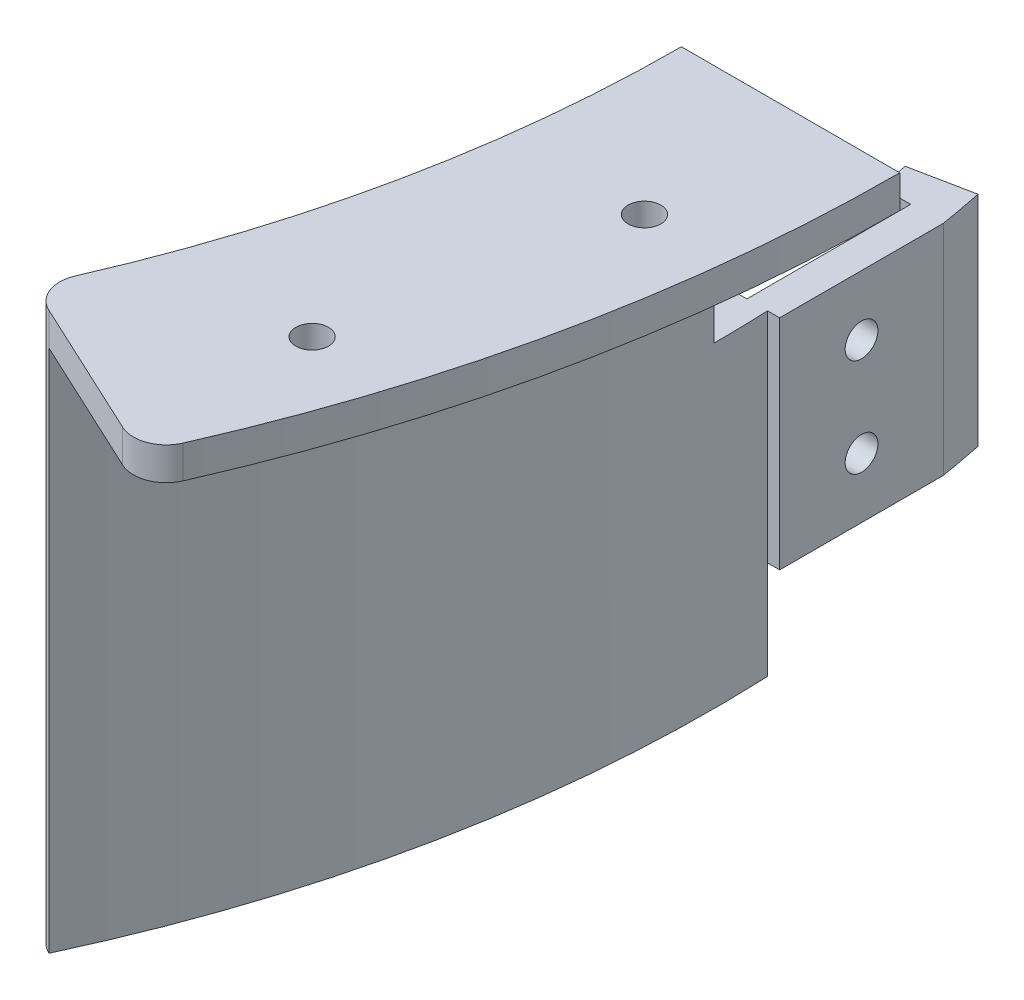
ISO-10303-21;
HEADER;
FILE_DESCRIPTION(('STEP AP214'),'2;1');
FILE_NAME('part.step','',(''),(''),'','','');
FILE_SCHEMA(('AUTOMOTIVE_DESIGN { 1 0 10303 214 1 1 1 1 }'));
ENDSEC;
DATA;
#1=APPLICATION_CONTEXT('core data for automotive mechanical design processes');
#2=APPLICATION_PROTOCOL_DEFINITION('international standard','automotive_design',2000,#1);
#3=PRODUCT_CONTEXT('',#1,'mechanical');
#4=PRODUCT('Part','Part','',(#3));
#5=PRODUCT_RELATED_PRODUCT_CATEGORY('part','',(#4));
#6=PRODUCT_DEFINITION_FORMATION('','',#4);
#7=PRODUCT_DEFINITION_CONTEXT('part definition',#1,'design');
#8=PRODUCT_DEFINITION('design','',#6,#7);
#9=PRODUCT_DEFINITION_SHAPE('','',#8);
#10=(LENGTH_UNIT() NAMED_UNIT(*) SI_UNIT(.MILLI.,.METRE.));
#11=(NAMED_UNIT(*) PLANE_ANGLE_UNIT() SI_UNIT($,.RADIAN.));
#12=(NAMED_UNIT(*) SI_UNIT($,.STERADIAN.) SOLID_ANGLE_UNIT());
#13=UNCERTAINTY_MEASURE_WITH_UNIT(LENGTH_MEASURE(1.E-05),#10,'distance_accuracy_value','');
#14=(GEOMETRIC_REPRESENTATION_CONTEXT(3) GLOBAL_UNCERTAINTY_ASSIGNED_CONTEXT((#13)) GLOBAL_UNIT_ASSIGNED_CONTEXT((#10,
#11,#12)) REPRESENTATION_CONTEXT('',''));
#15=CARTESIAN_POINT('',(0.,0.,0.));
#16=DIRECTION('',(0.,0.,1.));
#17=DIRECTION('',(1.,0.,0.));
#18=AXIS2_PLACEMENT_3D('',#15,#16,#17);
#19=CARTESIAN_POINT('',(0.,-64.,0.));
#20=DIRECTION('',(0.,1.,0.));
#21=DIRECTION('',(0.,0.,-1.));
#22=AXIS2_PLACEMENT_3D('',#19,#20,#21);
#23=CYLINDRICAL_SURFACE('',#22,115.);
#24=CARTESIAN_POINT('',(0.,0.,0.));
#25=DIRECTION('',(0.,-1.,0.));
#26=DIRECTION('',(0.,0.,-1.));
#27=AXIS2_PLACEMENT_3D('',#24,#25,#26);
#28=CIRCLE('',#27,115.);
#29=CARTESIAN_POINT('',(115.,0.,0.));
#30=VERTEX_POINT('',#29);
#31=CARTESIAN_POINT('',(105.427327378107,0.,45.9355923213096));
#32=VERTEX_POINT('',#31);
#33=EDGE_CURVE('E279',#30,#32,#28,.T.);
#34=ORIENTED_EDGE('',*,*,#33,.F.);
#35=DIRECTION('',(0.,1.,0.));
#36=VECTOR('',#35,1.);
#37=CARTESIAN_POINT('',(115.,-22.,0.));
#38=LINE('',#37,#36);
#39=CARTESIAN_POINT('',(115.,-22.,0.));
#40=VERTEX_POINT('',#39);
#41=EDGE_CURVE('E237',#40,#30,#38,.T.);
#42=ORIENTED_EDGE('',*,*,#41,.F.);
#43=CARTESIAN_POINT('',(0.,-22.,0.));
#44=DIRECTION('',(0.,-1.,0.));
#45=DIRECTION('',(0.,0.,-1.));
#46=AXIS2_PLACEMENT_3D('',#43,#44,#45);
#47=CIRCLE('',#46,115.);
#48=CARTESIAN_POINT('',(114.891252930761,-22.,-5.00000000000003));
#49=VERTEX_POINT('',#48);
#50=EDGE_CURVE('E221',#40,#49,#47,.F.);
#51=ORIENTED_EDGE('',*,*,#50,.T.);
#52=DIRECTION('',(0.,1.,0.));
#53=VECTOR('',#52,1.);
#54=CARTESIAN_POINT('',(114.891252930761,-64.,-5.));
#55=LINE('',#54,#53);
#56=CARTESIAN_POINT('',(114.891252930761,-51.,-4.99999999999999));
#57=VERTEX_POINT('',#56);
#58=EDGE_CURVE('E296',#57,#49,#55,.T.);
#59=ORIENTED_EDGE('',*,*,#58,.F.);
#60=CARTESIAN_POINT('',(0.,-51.,0.));
#61=DIRECTION('',(0.,-1.,0.));
#62=DIRECTION('',(0.,0.,1.));
#63=AXIS2_PLACEMENT_3D('',#60,#61,#62);
#64=CIRCLE('',#63,115.);
#65=CARTESIAN_POINT('',(105.427327378106,-51.,45.9355923213096));
#66=VERTEX_POINT('',#65);
#67=EDGE_CURVE('E183',#57,#66,#64,.T.);
#68=ORIENTED_EDGE('',*,*,#67,.T.);
#69=DIRECTION('',(0.,1.,0.));
#70=VECTOR('',#69,1.);
#71=CARTESIAN_POINT('',(105.427327378106,-64.,45.9355923213096));
#72=LINE('',#71,#70);
#73=EDGE_CURVE('E45',#32,#66,#72,.F.);
#74=ORIENTED_EDGE('',*,*,#73,.F.);
#75=EDGE_LOOP('',(#34,#42,#51,#59,#68,#74));
#76=FACE_BOUND('',#75,.T.);
#77=ADVANCED_FACE('F37',(#76),#23,.F.);
#78=CARTESIAN_POINT('',(113.,-84.,-5.));
#79=DIRECTION('',(0.,0.,1.));
#80=DIRECTION('',(-1.,0.,0.));
#81=AXIS2_PLACEMENT_3D('',#78,#79,#80);
#82=PLANE('',#81);
#83=DIRECTION('',(-1.,0.,0.));
#84=VECTOR('',#83,1.);
#85=CARTESIAN_POINT('',(117.894020204589,-51.,-5.));
#86=LINE('',#85,#84);
#87=CARTESIAN_POINT('',(117.894020204589,-51.,-5.));
#88=VERTEX_POINT('',#87);
#89=EDGE_CURVE('E169',#88,#57,#86,.T.);
#90=ORIENTED_EDGE('',*,*,#89,.T.);
#91=ORIENTED_EDGE('',*,*,#58,.T.);
#92=DIRECTION('',(1.,0.,0.));
#93=VECTOR('',#92,1.);
#94=CARTESIAN_POINT('',(0.,-22.,-5.00000000000003));
#95=LINE('',#94,#93);
#96=CARTESIAN_POINT('',(116.,-22.,-5.));
#97=VERTEX_POINT('',#96);
#98=EDGE_CURVE('E224',#49,#97,#95,.T.);
#99=ORIENTED_EDGE('',*,*,#98,.T.);
#100=DIRECTION('',(0.,1.,0.));
#101=VECTOR('',#100,1.);
#102=CARTESIAN_POINT('',(116.,-84.,-5.));
#103=LINE('',#102,#101);
#104=CARTESIAN_POINT('',(116.,-42.,-5.));
#105=VERTEX_POINT('',#104);
#106=EDGE_CURVE('E276',#105,#97,#103,.T.);
#107=ORIENTED_EDGE('',*,*,#106,.F.);
#108=DIRECTION('',(1.,0.,0.));
#109=VECTOR('',#108,1.);
#110=CARTESIAN_POINT('',(116.,-42.,-5.));
#111=LINE('',#110,#109);
#112=CARTESIAN_POINT('',(117.894020204589,-42.,-5.));
#113=VERTEX_POINT('',#112);
#114=EDGE_CURVE('E177',#105,#113,#111,.T.);
#115=ORIENTED_EDGE('',*,*,#114,.T.);
#116=DIRECTION('',(0.,-1.,0.));
#117=VECTOR('',#116,1.);
#118=CARTESIAN_POINT('',(117.894020204589,-3.,-5.));
#119=LINE('',#118,#117);
#120=EDGE_CURVE('E163',#113,#88,#119,.T.);
#121=ORIENTED_EDGE('',*,*,#120,.T.);
#122=EDGE_LOOP('',(#90,#91,#99,#107,#115,#121));
#123=FACE_BOUND('',#122,.T.);
#124=ADVANCED_FACE('F173',(#123),#82,.F.);
#125=CARTESIAN_POINT('',(0.,-3.,0.));
#126=DIRECTION('',(0.,-1.,0.));
#127=DIRECTION('',(0.,0.,1.));
#128=AXIS2_PLACEMENT_3D('',#125,#126,#127);
#129=CYLINDRICAL_SURFACE('',#128,118.);
#130=CARTESIAN_POINT('',(0.,-51.,0.));
#131=DIRECTION('',(0.,1.,0.));
#132=DIRECTION('',(0.,0.,1.));
#133=AXIS2_PLACEMENT_3D('',#130,#131,#132);
#134=CIRCLE('',#133,118.);
#135=CARTESIAN_POINT('',(106.944318870325,-51.,49.8689548854027));
#136=VERTEX_POINT('',#135);
#137=EDGE_CURVE('E159',#136,#88,#134,.T.);
#138=ORIENTED_EDGE('',*,*,#137,.T.);
#139=ORIENTED_EDGE('',*,*,#120,.F.);
#140=DIRECTION('',(0.,-1.,0.));
#141=VECTOR('',#140,1.);
#142=CARTESIAN_POINT('',(117.894020204589,-3.,-5.));
#143=LINE('',#142,#141);
#144=CARTESIAN_POINT('',(117.894020204589,-22.,-5.));
#145=VERTEX_POINT('',#144);
#146=EDGE_CURVE('E262',#145,#113,#143,.T.);
#147=ORIENTED_EDGE('',*,*,#146,.F.);
#148=CARTESIAN_POINT('',(0.,-22.,0.));
#149=DIRECTION('',(0.,-1.,0.));
#150=DIRECTION('',(0.,0.,-1.));
#151=AXIS2_PLACEMENT_3D('',#148,#149,#150);
#152=CIRCLE('',#151,118.);
#153=CARTESIAN_POINT('',(118.,-22.,0.));
#154=VERTEX_POINT('',#153);
#155=EDGE_CURVE('E251',#145,#154,#152,.T.);
#156=ORIENTED_EDGE('',*,*,#155,.T.);
#157=DIRECTION('',(0.,-1.,0.));
#158=VECTOR('',#157,1.);
#159=CARTESIAN_POINT('',(118.,-3.,0.));
#160=LINE('',#159,#158);
#161=CARTESIAN_POINT('',(118.,-3.,0.));
#162=VERTEX_POINT('',#161);
#163=EDGE_CURVE('E242',#154,#162,#160,.F.);
#164=ORIENTED_EDGE('',*,*,#163,.T.);
#165=CARTESIAN_POINT('',(0.,-3.,0.));
#166=DIRECTION('',(0.,-1.,0.));
#167=DIRECTION('',(0.,0.,1.));
#168=AXIS2_PLACEMENT_3D('',#165,#166,#167);
#169=CIRCLE('',#168,118.);
#170=CARTESIAN_POINT('',(106.944318870325,-3.,49.8689548854027));
#171=VERTEX_POINT('',#170);
#172=EDGE_CURVE('E254',#162,#171,#169,.T.);
#173=ORIENTED_EDGE('',*,*,#172,.T.);
#174=DIRECTION('',(0.,-1.,0.));
#175=VECTOR('',#174,1.);
#176=CARTESIAN_POINT('',(106.944318870325,-3.,49.8689548854027));
#177=LINE('',#176,#175);
#178=EDGE_CURVE('E167',#171,#136,#177,.T.);
#179=ORIENTED_EDGE('',*,*,#178,.T.);
#180=EDGE_LOOP('',(#138,#139,#147,#156,#164,#173,#179));
#181=FACE_BOUND('',#180,.T.);
#182=ADVANCED_FACE('F161',(#181),#129,.T.);
#183=CARTESIAN_POINT('',(0.,-64.,0.));
#184=DIRECTION('',(-0.422618261740701,0.,0.906307787036649));
#185=DIRECTION('',(-0.906307787036649,0.,-0.422618261740701));
#186=AXIS2_PLACEMENT_3D('',#183,#184,#185);
#187=PLANE('',#186);
#188=DIRECTION('',(0.906307787036652,0.,0.422618261740695));
#189=VECTOR('',#188,1.);
#190=CARTESIAN_POINT('',(106.944318870325,-51.,49.8689548854027));
#191=LINE('',#190,#189);
#192=CARTESIAN_POINT('',(106.9097506984,-51.,49.8528354821059));
#193=VERTEX_POINT('',#192);
#194=EDGE_CURVE('E186',#193,#136,#191,.T.);
#195=ORIENTED_EDGE('',*,*,#194,.T.);
#196=ORIENTED_EDGE('',*,*,#178,.F.);
#197=DIRECTION('',(0.906307787036649,0.,0.422618261740701));
#198=VECTOR('',#197,1.);
#199=CARTESIAN_POINT('',(106.944318870325,-3.,49.8689548854027));
#200=LINE('',#199,#198);
#201=CARTESIAN_POINT('',(119.601727041651,-3.,55.7712012480857));
#202=VERTEX_POINT('',#201);
#203=EDGE_CURVE('E256',#171,#202,#200,.T.);
#204=ORIENTED_EDGE('',*,*,#203,.T.);
#205=DIRECTION('',(0.,1.,0.));
#206=VECTOR('',#205,1.);
#207=CARTESIAN_POINT('',(119.601727041651,-64.,55.7712012480857));
#208=LINE('',#207,#206);
#209=CARTESIAN_POINT('',(119.601727041651,0.,55.7712012480857));
#210=VERTEX_POINT('',#209);
#211=EDGE_CURVE('E307',#210,#202,#208,.F.);
#212=ORIENTED_EDGE('',*,*,#211,.F.);
#213=DIRECTION('',(-0.906307787036649,0.,-0.422618261740701));
#214=VECTOR('',#213,1.);
#215=CARTESIAN_POINT('',(0.,0.,0.));
#216=LINE('',#215,#214);
#217=CARTESIAN_POINT('',(106.9097506984,0.,49.8528354821059));
#218=VERTEX_POINT('',#217);
#219=EDGE_CURVE('E290',#210,#218,#216,.T.);
#220=ORIENTED_EDGE('',*,*,#219,.T.);
#221=DIRECTION('',(0.,-1.,0.));
#222=VECTOR('',#221,1.);
#223=CARTESIAN_POINT('',(106.9097506984,0.,49.8528354821059));
#224=LINE('',#223,#222);
#225=EDGE_CURVE('E312',#193,#218,#224,.F.);
#226=ORIENTED_EDGE('',*,*,#225,.F.);
#227=EDGE_LOOP('',(#195,#196,#204,#212,#220,#226));
#228=FACE_BOUND('',#227,.T.);
#229=ADVANCED_FACE('F351',(#228),#187,.T.);
#230=CARTESIAN_POINT('',(132.328890592719,-64.,-26.7219893439865));
#231=DIRECTION('',(-0.197940661807307,0.,-0.980214004390513));
#232=DIRECTION('',(0.980214004390513,0.,-0.197940661807307));
#233=AXIS2_PLACEMENT_3D('',#230,#231,#232);
#234=PLANE('',#233);
#235=DIRECTION('',(0.,1.,0.));
#236=VECTOR('',#235,1.);
#237=CARTESIAN_POINT('',(112.724610504909,-64.,-22.7631761078404));
#238=LINE('',#237,#236);
#239=CARTESIAN_POINT('',(112.724610504909,-42.,-22.7631761078404));
#240=VERTEX_POINT('',#239);
#241=CARTESIAN_POINT('',(112.724610504909,-22.,-22.7631761078403));
#242=VERTEX_POINT('',#241);
#243=EDGE_CURVE('E284',#240,#242,#238,.T.);
#244=ORIENTED_EDGE('',*,*,#243,.T.);
#245=DIRECTION('',(0.980214004390513,0.,-0.197940661807307));
#246=VECTOR('',#245,1.);
#247=CARTESIAN_POINT('',(0.,-22.,0.));
#248=LINE('',#247,#246);
#249=CARTESIAN_POINT('',(118.281412986176,-22.,-23.8852955182423));
#250=VERTEX_POINT('',#249);
#251=EDGE_CURVE('E234',#242,#250,#248,.T.);
#252=ORIENTED_EDGE('',*,*,#251,.T.);
#253=DIRECTION('',(0.,-1.,0.));
#254=VECTOR('',#253,1.);
#255=CARTESIAN_POINT('',(118.281412986176,-3.,-23.8852955182423));
#256=LINE('',#255,#254);
#257=CARTESIAN_POINT('',(118.281412986176,-42.,-23.8852955182423));
#258=VERTEX_POINT('',#257);
#259=EDGE_CURVE('E272',#250,#258,#256,.T.);
#260=ORIENTED_EDGE('',*,*,#259,.T.);
#261=DIRECTION('',(-0.980214004390514,0.,0.197940661807305));
#262=VECTOR('',#261,1.);
#263=CARTESIAN_POINT('',(118.281412986176,-42.,-23.8852955182423));
#264=LINE('',#263,#262);
#265=EDGE_CURVE('E212',#258,#240,#264,.T.);
#266=ORIENTED_EDGE('',*,*,#265,.T.);
#267=EDGE_LOOP('',(#244,#252,#260,#266));
#268=FACE_BOUND('',#267,.T.);
#269=ADVANCED_FACE('F382',(#268),#234,.T.);
#270=CARTESIAN_POINT('',(0.,-42.,0.));
#271=DIRECTION('',(0.,-1.,0.));
#272=DIRECTION('',(0.,0.,1.));
#273=AXIS2_PLACEMENT_3D('',#270,#271,#272);
#274=CIRCLE('',#273,115.);
#275=CARTESIAN_POINT('',(113.247516529061,-42.,-20.));
#276=VERTEX_POINT('',#275);
#277=EDGE_CURVE('E215',#240,#276,#274,.T.);
#278=ORIENTED_EDGE('',*,*,#277,.T.);
#279=DIRECTION('',(0.,1.,0.));
#280=VECTOR('',#279,1.);
#281=CARTESIAN_POINT('',(113.247516529061,-64.,-20.));
#282=LINE('',#281,#280);
#283=CARTESIAN_POINT('',(113.247516529061,-22.,-20.));
#284=VERTEX_POINT('',#283);
#285=EDGE_CURVE('E293',#284,#276,#282,.F.);
#286=ORIENTED_EDGE('',*,*,#285,.F.);
#287=CARTESIAN_POINT('',(0.,-22.,0.));
#288=DIRECTION('',(0.,-1.,0.));
#289=DIRECTION('',(0.,0.,-1.));
#290=AXIS2_PLACEMENT_3D('',#287,#288,#289);
#291=CIRCLE('',#290,115.);
#292=EDGE_CURVE('E232',#284,#242,#291,.F.);
#293=ORIENTED_EDGE('',*,*,#292,.T.);
#294=ORIENTED_EDGE('',*,*,#243,.F.);
#295=EDGE_LOOP('',(#278,#286,#293,#294));
#296=FACE_BOUND('',#295,.T.);
#297=ADVANCED_FACE('F374',(#296),#23,.F.);
#298=CARTESIAN_POINT('',(116.,-84.,-5.));
#299=DIRECTION('',(1.,0.,0.));
#300=DIRECTION('',(0.,0.,1.));
#301=AXIS2_PLACEMENT_3D('',#298,#299,#300);
#302=PLANE('',#301);
#303=CARTESIAN_POINT('',(116.,-27.5,-12.5));
#304=DIRECTION('',(-1.,0.,0.));
#305=DIRECTION('',(0.,0.,1.));
#306=AXIS2_PLACEMENT_3D('',#303,#304,#305);
#307=CIRCLE('',#306,1.5);
#308=CARTESIAN_POINT('',(116.,-27.5,-11.));
#309=VERTEX_POINT('',#308);
#310=EDGE_CURVE('E200',#309,#309,#307,.T.);
#311=ORIENTED_EDGE('',*,*,#310,.F.);
#312=EDGE_LOOP('',(#311));
#313=FACE_BOUND('',#312,.T.);
#314=CARTESIAN_POINT('',(116.,-36.5,-12.5));
#315=DIRECTION('',(-1.,0.,0.));
#316=DIRECTION('',(0.,0.,1.));
#317=AXIS2_PLACEMENT_3D('',#314,#315,#316);
#318=CIRCLE('',#317,1.5);
#319=CARTESIAN_POINT('',(116.,-36.5,-11.));
#320=VERTEX_POINT('',#319);
#321=EDGE_CURVE('E195',#320,#320,#318,.T.);
#322=ORIENTED_EDGE('',*,*,#321,.F.);
#323=EDGE_LOOP('',(#322));
#324=FACE_BOUND('',#323,.T.);
#325=DIRECTION('',(0.,0.,1.));
#326=VECTOR('',#325,1.);
#327=CARTESIAN_POINT('',(116.,-42.,-20.));
#328=LINE('',#327,#326);
#329=CARTESIAN_POINT('',(116.,-42.,-20.));
#330=VERTEX_POINT('',#329);
#331=EDGE_CURVE('E203',#330,#105,#328,.T.);
#332=ORIENTED_EDGE('',*,*,#331,.T.);
#333=ORIENTED_EDGE('',*,*,#106,.T.);
#334=DIRECTION('',(0.,0.,-1.));
#335=VECTOR('',#334,1.);
#336=CARTESIAN_POINT('',(116.,-22.,1.07321559047098E-13));
#337=LINE('',#336,#335);
#338=CARTESIAN_POINT('',(116.,-22.,-20.));
#339=VERTEX_POINT('',#338);
#340=EDGE_CURVE('E227',#97,#339,#337,.T.);
#341=ORIENTED_EDGE('',*,*,#340,.T.);
#342=DIRECTION('',(0.,1.,0.));
#343=VECTOR('',#342,1.);
#344=CARTESIAN_POINT('',(116.,-84.,-20.));
#345=LINE('',#344,#343);
#346=EDGE_CURVE('E265',#330,#339,#345,.T.);
#347=ORIENTED_EDGE('',*,*,#346,.F.);
#348=EDGE_LOOP('',(#332,#333,#341,#347));
#349=FACE_BOUND('',#348,.T.);
#350=ADVANCED_FACE('F331',(#313,#324,#349),#302,.F.);
#351=CARTESIAN_POINT('',(113.,-84.,-20.));
#352=DIRECTION('',(0.,0.,-1.));
#353=DIRECTION('',(1.,0.,0.));
#354=AXIS2_PLACEMENT_3D('',#351,#352,#353);
#355=PLANE('',#354);
#356=DIRECTION('',(1.,0.,0.));
#357=VECTOR('',#356,1.);
#358=CARTESIAN_POINT('',(113.247516529061,-42.,-20.));
#359=LINE('',#358,#357);
#360=EDGE_CURVE('E179',#276,#330,#359,.T.);
#361=ORIENTED_EDGE('',*,*,#360,.T.);
#362=ORIENTED_EDGE('',*,*,#346,.T.);
#363=DIRECTION('',(-1.,0.,0.));
#364=VECTOR('',#363,1.);
#365=CARTESIAN_POINT('',(0.,-22.,-20.));
#366=LINE('',#365,#364);
#367=EDGE_CURVE('E230',#339,#284,#366,.T.);
#368=ORIENTED_EDGE('',*,*,#367,.T.);
#369=ORIENTED_EDGE('',*,*,#285,.T.);
#370=EDGE_LOOP('',(#361,#362,#368,#369));
#371=FACE_BOUND('',#370,.T.);
#372=ADVANCED_FACE('F388',(#371),#355,.F.);
#373=CARTESIAN_POINT('',(119.,-3.,-5.));
#374=DIRECTION('',(0.,0.,-1.));
#375=DIRECTION('',(1.,0.,0.));
#376=AXIS2_PLACEMENT_3D('',#373,#374,#375);
#377=PLANE('',#376);
#378=CARTESIAN_POINT('',(119.,-42.,-5.));
#379=VERTEX_POINT('',#378);
#380=EDGE_CURVE('E205',#113,#379,#111,.T.);
#381=ORIENTED_EDGE('',*,*,#380,.T.);
#382=DIRECTION('',(0.,-1.,0.));
#383=VECTOR('',#382,1.);
#384=CARTESIAN_POINT('',(119.,-3.,-5.));
#385=LINE('',#384,#383);
#386=CARTESIAN_POINT('',(119.,-22.,-5.));
#387=VERTEX_POINT('',#386);
#388=EDGE_CURVE('E266',#387,#379,#385,.T.);
#389=ORIENTED_EDGE('',*,*,#388,.F.);
#390=DIRECTION('',(-1.,0.,0.));
#391=VECTOR('',#390,1.);
#392=CARTESIAN_POINT('',(119.,-22.,-5.));
#393=LINE('',#392,#391);
#394=EDGE_CURVE('E249',#387,#145,#393,.T.);
#395=ORIENTED_EDGE('',*,*,#394,.T.);
#396=ORIENTED_EDGE('',*,*,#146,.T.);
#397=EDGE_LOOP('',(#381,#389,#395,#396));
#398=FACE_BOUND('',#397,.T.);
#399=ADVANCED_FACE('F338',(#398),#377,.F.);
#400=CARTESIAN_POINT('',(119.,-3.,-20.));
#401=DIRECTION('',(-1.,0.,0.));
#402=DIRECTION('',(0.,0.,-1.));
#403=AXIS2_PLACEMENT_3D('',#400,#401,#402);
#404=PLANE('',#403);
#405=CARTESIAN_POINT('',(119.,-27.5,-12.5));
#406=DIRECTION('',(-1.,0.,0.));
#407=DIRECTION('',(0.,0.,1.));
#408=AXIS2_PLACEMENT_3D('',#405,#406,#407);
#409=CIRCLE('',#408,1.5);
#410=CARTESIAN_POINT('',(119.,-27.5,-11.));
#411=VERTEX_POINT('',#410);
#412=EDGE_CURVE('E192',#411,#411,#409,.T.);
#413=ORIENTED_EDGE('',*,*,#412,.T.);
#414=EDGE_LOOP('',(#413));
#415=FACE_BOUND('',#414,.T.);
#416=CARTESIAN_POINT('',(119.,-36.5,-12.5));
#417=DIRECTION('',(-1.,0.,0.));
#418=DIRECTION('',(0.,0.,1.));
#419=AXIS2_PLACEMENT_3D('',#416,#417,#418);
#420=CIRCLE('',#419,1.5);
#421=CARTESIAN_POINT('',(119.,-36.5,-11.));
#422=VERTEX_POINT('',#421);
#423=EDGE_CURVE('E191',#422,#422,#420,.T.);
#424=ORIENTED_EDGE('',*,*,#423,.T.);
#425=EDGE_LOOP('',(#424));
#426=FACE_BOUND('',#425,.T.);
#427=DIRECTION('',(0.,0.,-1.));
#428=VECTOR('',#427,1.);
#429=CARTESIAN_POINT('',(119.,-42.,-5.));
#430=LINE('',#429,#428);
#431=CARTESIAN_POINT('',(119.,-42.,-20.));
#432=VERTEX_POINT('',#431);
#433=EDGE_CURVE('E207',#379,#432,#430,.T.);
#434=ORIENTED_EDGE('',*,*,#433,.T.);
#435=DIRECTION('',(0.,-1.,0.));
#436=VECTOR('',#435,1.);
#437=CARTESIAN_POINT('',(119.,-3.,-20.));
#438=LINE('',#437,#436);
#439=CARTESIAN_POINT('',(119.,-22.,-20.));
#440=VERTEX_POINT('',#439);
#441=EDGE_CURVE('E269',#440,#432,#438,.T.);
#442=ORIENTED_EDGE('',*,*,#441,.F.);
#443=DIRECTION('',(0.,0.,1.));
#444=VECTOR('',#443,1.);
#445=CARTESIAN_POINT('',(119.,-22.,-20.));
#446=LINE('',#445,#444);
#447=EDGE_CURVE('E247',#440,#387,#446,.T.);
#448=ORIENTED_EDGE('',*,*,#447,.T.);
#449=ORIENTED_EDGE('',*,*,#388,.T.);
#450=EDGE_LOOP('',(#434,#442,#448,#449));
#451=FACE_BOUND('',#450,.T.);
#452=ADVANCED_FACE('F401',(#415,#426,#451),#404,.F.);
#453=CARTESIAN_POINT('',(0.,-3.,0.));
#454=DIRECTION('',(0.,-1.,0.));
#455=DIRECTION('',(0.,0.,1.));
#456=AXIS2_PLACEMENT_3D('',#453,#454,#455);
#457=CYLINDRICAL_SURFACE('',#456,120.668968670491);
#458=CARTESIAN_POINT('',(0.,-42.,0.));
#459=DIRECTION('',(0.,1.,0.));
#460=DIRECTION('',(0.,0.,1.));
#461=AXIS2_PLACEMENT_3D('',#458,#459,#460);
#462=CIRCLE('',#461,120.668968670491);
#463=EDGE_CURVE('E210',#432,#258,#462,.T.);
#464=ORIENTED_EDGE('',*,*,#463,.T.);
#465=ORIENTED_EDGE('',*,*,#259,.F.);
#466=CARTESIAN_POINT('',(0.,-22.,0.));
#467=DIRECTION('',(0.,-1.,0.));
#468=DIRECTION('',(0.,0.,-1.));
#469=AXIS2_PLACEMENT_3D('',#466,#467,#468);
#470=CIRCLE('',#469,120.668968670491);
#471=EDGE_CURVE('E300',#250,#440,#470,.T.);
#472=ORIENTED_EDGE('',*,*,#471,.T.);
#473=ORIENTED_EDGE('',*,*,#441,.T.);
#474=EDGE_LOOP('',(#464,#465,#472,#473));
#475=FACE_BOUND('',#474,.T.);
#476=ADVANCED_FACE('F398',(#475),#457,.T.);
#477=CARTESIAN_POINT('',(0.,-64.,0.));
#478=DIRECTION('',(0.,1.,0.));
#479=DIRECTION('',(0.,0.,-1.));
#480=AXIS2_PLACEMENT_3D('',#477,#478,#479);
#481=CYLINDRICAL_SURFACE('',#480,135.);
#482=CARTESIAN_POINT('',(0.,-3.,0.));
#483=DIRECTION('',(0.,1.,0.));
#484=DIRECTION('',(0.,0.,1.));
#485=AXIS2_PLACEMENT_3D('',#482,#483,#484);
#486=CIRCLE('',#485,135.);
#487=CARTESIAN_POINT('',(123.616617777484,-3.,54.2580114753161));
#488=VERTEX_POINT('',#487);
#489=CARTESIAN_POINT('',(135.,-3.,0.));
#490=VERTEX_POINT('',#489);
#491=EDGE_CURVE('E259',#488,#490,#486,.T.);
#492=ORIENTED_EDGE('',*,*,#491,.T.);
#493=DIRECTION('',(0.,1.,0.));
#494=VECTOR('',#493,1.);
#495=CARTESIAN_POINT('',(135.,-22.,0.));
#496=LINE('',#495,#494);
#497=CARTESIAN_POINT('',(135.,0.,0.));
#498=VERTEX_POINT('',#497);
#499=EDGE_CURVE('E239',#490,#498,#496,.T.);
#500=ORIENTED_EDGE('',*,*,#499,.T.);
#501=CARTESIAN_POINT('',(0.,0.,0.));
#502=DIRECTION('',(0.,-1.,0.));
#503=DIRECTION('',(0.,0.,-1.));
#504=AXIS2_PLACEMENT_3D('',#501,#502,#503);
#505=CIRCLE('',#504,135.);
#506=CARTESIAN_POINT('',(123.616617777484,0.,54.2580114753161));
#507=VERTEX_POINT('',#506);
#508=EDGE_CURVE('E287',#498,#507,#505,.T.);
#509=ORIENTED_EDGE('',*,*,#508,.T.);
#510=DIRECTION('',(0.,1.,0.));
#511=VECTOR('',#510,1.);
#512=CARTESIAN_POINT('',(123.616617777484,-64.,54.2580114753161));
#513=LINE('',#512,#511);
#514=EDGE_CURVE('E302',#488,#507,#513,.T.);
#515=ORIENTED_EDGE('',*,*,#514,.F.);
#516=EDGE_LOOP('',(#492,#500,#509,#515));
#517=FACE_BOUND('',#516,.T.);
#518=ADVANCED_FACE('F358',(#517),#481,.T.);
#519=CARTESIAN_POINT('',(0.,0.,0.));
#520=DIRECTION('',(0.,1.,0.));
#521=DIRECTION('',(0.,0.,-1.));
#522=AXIS2_PLACEMENT_3D('',#519,#520,#521);
#523=PLANE('',#522);
#524=CARTESIAN_POINT('',(121.091047044846,0.,39.9150137865815));
#525=DIRECTION('',(0.,-1.,0.));
#526=DIRECTION('',(0.,0.,-1.));
#527=AXIS2_PLACEMENT_3D('',#524,#525,#526);
#528=CIRCLE('',#527,1.5);
#529=CARTESIAN_POINT('',(121.091047044846,0.,38.4150137865816));
#530=VERTEX_POINT('',#529);
#531=EDGE_CURVE('E316',#530,#530,#528,.T.);
#532=ORIENTED_EDGE('',*,*,#531,.T.);
#533=EDGE_LOOP('',(#532));
#534=FACE_BOUND('',#533,.T.);
#535=CARTESIAN_POINT('',(126.614572621006,0.,15.));
#536=DIRECTION('',(0.,-1.,0.));
#537=DIRECTION('',(0.,0.,-1.));
#538=AXIS2_PLACEMENT_3D('',#535,#536,#537);
#539=CIRCLE('',#538,1.49999999999997);
#540=CARTESIAN_POINT('',(126.614572621006,0.,13.5));
#541=VERTEX_POINT('',#540);
#542=EDGE_CURVE('E544',#541,#541,#539,.T.);
#543=ORIENTED_EDGE('',*,*,#542,.T.);
#544=EDGE_LOOP('',(#543));
#545=FACE_BOUND('',#544,.T.);
#546=ORIENTED_EDGE('',*,*,#219,.F.);
#547=CARTESIAN_POINT('',(120.869581826873,0.,53.0522778869758));
#548=DIRECTION('',(0.,-1.,0.));
#549=DIRECTION('',(0.,0.,-1.));
#550=AXIS2_PLACEMENT_3D('',#547,#548,#549);
#551=CIRCLE('',#550,3.);
#552=EDGE_CURVE('E305',#507,#210,#551,.T.);
#553=ORIENTED_EDGE('',*,*,#552,.F.);
#554=ORIENTED_EDGE('',*,*,#508,.F.);
#555=DIRECTION('',(1.,0.,0.));
#556=VECTOR('',#555,1.);
#557=CARTESIAN_POINT('',(0.,0.,0.));
#558=LINE('',#557,#556);
#559=EDGE_CURVE('E178',#30,#498,#558,.T.);
#560=ORIENTED_EDGE('',*,*,#559,.F.);
#561=ORIENTED_EDGE('',*,*,#33,.T.);
#562=CARTESIAN_POINT('',(108.177605483622,0.,47.133912120996));
#563=DIRECTION('',(0.,-1.,0.));
#564=DIRECTION('',(0.,0.,-1.));
#565=AXIS2_PLACEMENT_3D('',#562,#563,#564);
#566=CIRCLE('',#565,3.);
#567=EDGE_CURVE('E57',#218,#32,#566,.T.);
#568=ORIENTED_EDGE('',*,*,#567,.F.);
#569=EDGE_LOOP('',(#546,#553,#554,#560,#561,#568));
#570=FACE_BOUND('',#569,.T.);
#571=ADVANCED_FACE('F354',(#534,#545,#570),#523,.T.);
#572=CARTESIAN_POINT('',(0.,-3.,0.));
#573=DIRECTION('',(0.,-1.,0.));
#574=DIRECTION('',(0.,0.,1.));
#575=AXIS2_PLACEMENT_3D('',#572,#573,#574);
#576=PLANE('',#575);
#577=CARTESIAN_POINT('',(121.091047044846,-3.,39.9150137865815));
#578=DIRECTION('',(0.,1.,0.));
#579=DIRECTION('',(0.,0.,1.));
#580=AXIS2_PLACEMENT_3D('',#577,#578,#579);
#581=CIRCLE('',#580,1.5);
#582=CARTESIAN_POINT('',(121.091047044846,-3.,41.4150137865815));
#583=VERTEX_POINT('',#582);
#584=EDGE_CURVE('E170',#583,#583,#581,.T.);
#585=ORIENTED_EDGE('',*,*,#584,.T.);
#586=EDGE_LOOP('',(#585));
#587=FACE_BOUND('',#586,.T.);
#588=CARTESIAN_POINT('',(126.614572621006,-3.,15.));
#589=DIRECTION('',(0.,1.,0.));
#590=DIRECTION('',(0.,0.,1.));
#591=AXIS2_PLACEMENT_3D('',#588,#589,#590);
#592=CIRCLE('',#591,1.49999999999997);
#593=CARTESIAN_POINT('',(126.614572621006,-3.,16.5));
#594=VERTEX_POINT('',#593);
#595=EDGE_CURVE('E313',#594,#594,#592,.T.);
#596=ORIENTED_EDGE('',*,*,#595,.T.);
#597=EDGE_LOOP('',(#596));
#598=FACE_BOUND('',#597,.T.);
#599=ORIENTED_EDGE('',*,*,#203,.F.);
#600=ORIENTED_EDGE('',*,*,#172,.F.);
#601=DIRECTION('',(-1.,0.,0.));
#602=VECTOR('',#601,1.);
#603=CARTESIAN_POINT('',(0.,-3.,0.));
#604=LINE('',#603,#602);
#605=EDGE_CURVE('E298',#490,#162,#604,.T.);
#606=ORIENTED_EDGE('',*,*,#605,.F.);
#607=ORIENTED_EDGE('',*,*,#491,.F.);
#608=CARTESIAN_POINT('',(120.869581826873,-3.,53.0522778869758));
#609=DIRECTION('',(0.,1.,0.));
#610=DIRECTION('',(0.,0.,1.));
#611=AXIS2_PLACEMENT_3D('',#608,#609,#610);
#612=CIRCLE('',#611,3.);
#613=EDGE_CURVE('E310',#202,#488,#612,.T.);
#614=ORIENTED_EDGE('',*,*,#613,.F.);
#615=EDGE_LOOP('',(#599,#600,#606,#607,#614));
#616=FACE_BOUND('',#615,.T.);
#617=ADVANCED_FACE('F348',(#587,#598,#616),#576,.T.);
#618=CARTESIAN_POINT('',(0.,-22.,0.));
#619=DIRECTION('',(0.,1.,0.));
#620=DIRECTION('',(0.,0.,-1.));
#621=AXIS2_PLACEMENT_3D('',#618,#619,#620);
#622=PLANE('',#621);
#623=ORIENTED_EDGE('',*,*,#155,.F.);
#624=ORIENTED_EDGE('',*,*,#394,.F.);
#625=ORIENTED_EDGE('',*,*,#447,.F.);
#626=ORIENTED_EDGE('',*,*,#471,.F.);
#627=ORIENTED_EDGE('',*,*,#251,.F.);
#628=ORIENTED_EDGE('',*,*,#292,.F.);
#629=ORIENTED_EDGE('',*,*,#367,.F.);
#630=ORIENTED_EDGE('',*,*,#340,.F.);
#631=ORIENTED_EDGE('',*,*,#98,.F.);
#632=ORIENTED_EDGE('',*,*,#50,.F.);
#633=DIRECTION('',(1.,0.,0.));
#634=VECTOR('',#633,1.);
#635=CARTESIAN_POINT('',(0.,-22.,0.));
#636=LINE('',#635,#634);
#637=EDGE_CURVE('E219',#40,#154,#636,.T.);
#638=ORIENTED_EDGE('',*,*,#637,.T.);
#639=EDGE_LOOP('',(#623,#624,#625,#626,#627,#628,#629,#630,#631,#632,#638));
#640=FACE_BOUND('',#639,.T.);
#641=ADVANCED_FACE('F327',(#640),#622,.T.);
#642=CARTESIAN_POINT('',(0.,-22.,0.));
#643=DIRECTION('',(0.,0.,-1.));
#644=DIRECTION('',(1.,0.,0.));
#645=AXIS2_PLACEMENT_3D('',#642,#643,#644);
#646=PLANE('',#645);
#647=ORIENTED_EDGE('',*,*,#163,.F.);
#648=ORIENTED_EDGE('',*,*,#637,.F.);
#649=ORIENTED_EDGE('',*,*,#41,.T.);
#650=ORIENTED_EDGE('',*,*,#559,.T.);
#651=ORIENTED_EDGE('',*,*,#499,.F.);
#652=ORIENTED_EDGE('',*,*,#605,.T.);
#653=EDGE_LOOP('',(#647,#648,#649,#650,#651,#652));
#654=FACE_BOUND('',#653,.T.);
#655=ADVANCED_FACE('F343',(#654),#646,.T.);
#656=CARTESIAN_POINT('',(0.,-42.,0.));
#657=DIRECTION('',(0.,-1.,0.));
#658=DIRECTION('',(0.,0.,1.));
#659=AXIS2_PLACEMENT_3D('',#656,#657,#658);
#660=PLANE('',#659);
#661=ORIENTED_EDGE('',*,*,#331,.F.);
#662=ORIENTED_EDGE('',*,*,#360,.F.);
#663=ORIENTED_EDGE('',*,*,#277,.F.);
#664=ORIENTED_EDGE('',*,*,#265,.F.);
#665=ORIENTED_EDGE('',*,*,#463,.F.);
#666=ORIENTED_EDGE('',*,*,#433,.F.);
#667=ORIENTED_EDGE('',*,*,#380,.F.);
#668=ORIENTED_EDGE('',*,*,#114,.F.);
#669=EDGE_LOOP('',(#661,#662,#663,#664,#665,#666,#667,#668));
#670=FACE_BOUND('',#669,.T.);
#671=ADVANCED_FACE('F334',(#670),#660,.T.);
#672=CARTESIAN_POINT('',(120.869581826873,-64.,53.0522778869758));
#673=DIRECTION('',(0.,1.,0.));
#674=DIRECTION('',(0.,0.,-1.));
#675=AXIS2_PLACEMENT_3D('',#672,#673,#674);
#676=CYLINDRICAL_SURFACE('',#675,3.);
#677=ORIENTED_EDGE('',*,*,#613,.T.);
#678=ORIENTED_EDGE('',*,*,#514,.T.);
#679=ORIENTED_EDGE('',*,*,#552,.T.);
#680=ORIENTED_EDGE('',*,*,#211,.T.);
#681=EDGE_LOOP('',(#677,#678,#679,#680));
#682=FACE_BOUND('',#681,.T.);
#683=ADVANCED_FACE('F360',(#682),#676,.T.);
#684=CARTESIAN_POINT('',(109.,-36.5,-12.5));
#685=DIRECTION('',(1.,0.,0.));
#686=DIRECTION('',(0.,0.,1.));
#687=AXIS2_PLACEMENT_3D('',#684,#685,#686);
#688=CYLINDRICAL_SURFACE('',#687,1.5);
#689=ORIENTED_EDGE('',*,*,#423,.F.);
#690=EDGE_LOOP('',(#689));
#691=FACE_BOUND('',#690,.T.);
#692=ORIENTED_EDGE('',*,*,#321,.T.);
#693=EDGE_LOOP('',(#692));
#694=FACE_BOUND('',#693,.T.);
#695=ADVANCED_FACE('F362',(#691,#694),#688,.F.);
#696=CARTESIAN_POINT('',(109.,-27.5,-12.5));
#697=DIRECTION('',(1.,0.,0.));
#698=DIRECTION('',(0.,0.,1.));
#699=AXIS2_PLACEMENT_3D('',#696,#697,#698);
#700=CYLINDRICAL_SURFACE('',#699,1.5);
#701=ORIENTED_EDGE('',*,*,#412,.F.);
#702=EDGE_LOOP('',(#701));
#703=FACE_BOUND('',#702,.T.);
#704=ORIENTED_EDGE('',*,*,#310,.T.);
#705=EDGE_LOOP('',(#704));
#706=FACE_BOUND('',#705,.T.);
#707=ADVANCED_FACE('F367',(#703,#706),#700,.F.);
#708=CARTESIAN_POINT('',(0.,-51.,0.));
#709=DIRECTION('',(0.,-1.,0.));
#710=DIRECTION('',(0.,0.,1.));
#711=AXIS2_PLACEMENT_3D('',#708,#709,#710);
#712=PLANE('',#711);
#713=ORIENTED_EDGE('',*,*,#67,.F.);
#714=ORIENTED_EDGE('',*,*,#89,.F.);
#715=ORIENTED_EDGE('',*,*,#137,.F.);
#716=ORIENTED_EDGE('',*,*,#194,.F.);
#717=CARTESIAN_POINT('',(108.177605483622,-51.,47.133912120996));
#718=DIRECTION('',(0.,1.,0.));
#719=DIRECTION('',(0.,0.,1.));
#720=AXIS2_PLACEMENT_3D('',#717,#718,#719);
#721=CIRCLE('',#720,3.);
#722=EDGE_CURVE('E11',#66,#193,#721,.T.);
#723=ORIENTED_EDGE('',*,*,#722,.F.);
#724=EDGE_LOOP('',(#713,#714,#715,#716,#723));
#725=FACE_BOUND('',#724,.T.);
#726=ADVANCED_FACE('F181',(#725),#712,.T.);
#727=CARTESIAN_POINT('',(126.614572621006,-10.,15.));
#728=DIRECTION('',(0.,1.,0.));
#729=DIRECTION('',(0.,0.,-1.));
#730=AXIS2_PLACEMENT_3D('',#727,#728,#729);
#731=CYLINDRICAL_SURFACE('',#730,1.49999999999997);
#732=ORIENTED_EDGE('',*,*,#595,.F.);
#733=EDGE_LOOP('',(#732));
#734=FACE_BOUND('',#733,.T.);
#735=ORIENTED_EDGE('',*,*,#542,.F.);
#736=EDGE_LOOP('',(#735));
#737=FACE_BOUND('',#736,.T.);
#738=ADVANCED_FACE('F510',(#734,#737),#731,.F.);
#739=CARTESIAN_POINT('',(121.091047044846,-10.,39.9150137865815));
#740=DIRECTION('',(0.,1.,0.));
#741=DIRECTION('',(0.,0.,-1.));
#742=AXIS2_PLACEMENT_3D('',#739,#740,#741);
#743=CYLINDRICAL_SURFACE('',#742,1.5);
#744=ORIENTED_EDGE('',*,*,#584,.F.);
#745=EDGE_LOOP('',(#744));
#746=FACE_BOUND('',#745,.T.);
#747=ORIENTED_EDGE('',*,*,#531,.F.);
#748=EDGE_LOOP('',(#747));
#749=FACE_BOUND('',#748,.T.);
#750=ADVANCED_FACE('F519',(#746,#749),#743,.F.);
#751=CARTESIAN_POINT('',(108.177605483622,-64.,47.133912120996));
#752=DIRECTION('',(0.,1.,0.));
#753=DIRECTION('',(0.,0.,-1.));
#754=AXIS2_PLACEMENT_3D('',#751,#752,#753);
#755=CYLINDRICAL_SURFACE('',#754,3.);
#756=ORIENTED_EDGE('',*,*,#722,.T.);
#757=ORIENTED_EDGE('',*,*,#225,.T.);
#758=ORIENTED_EDGE('',*,*,#567,.T.);
#759=ORIENTED_EDGE('',*,*,#73,.T.);
#760=EDGE_LOOP('',(#756,#757,#758,#759));
#761=FACE_BOUND('',#760,.T.);
#762=ADVANCED_FACE('F39',(#761),#755,.T.);
#763=CLOSED_SHELL('',(#77,#124,#182,#229,#269,#297,#350,#372,#399,#452,#476,#518,#571,#617,#641,
#655,#671,#683,#695,#707,#726,#738,#750,#762));
#764=MANIFOLD_SOLID_BREP('B2',#763);
#765=ADVANCED_BREP_SHAPE_REPRESENTATION('',(#18,#764),#14);
#766=SHAPE_DEFINITION_REPRESENTATION(#9,#765);
ENDSEC;
END-ISO-10303-21;
